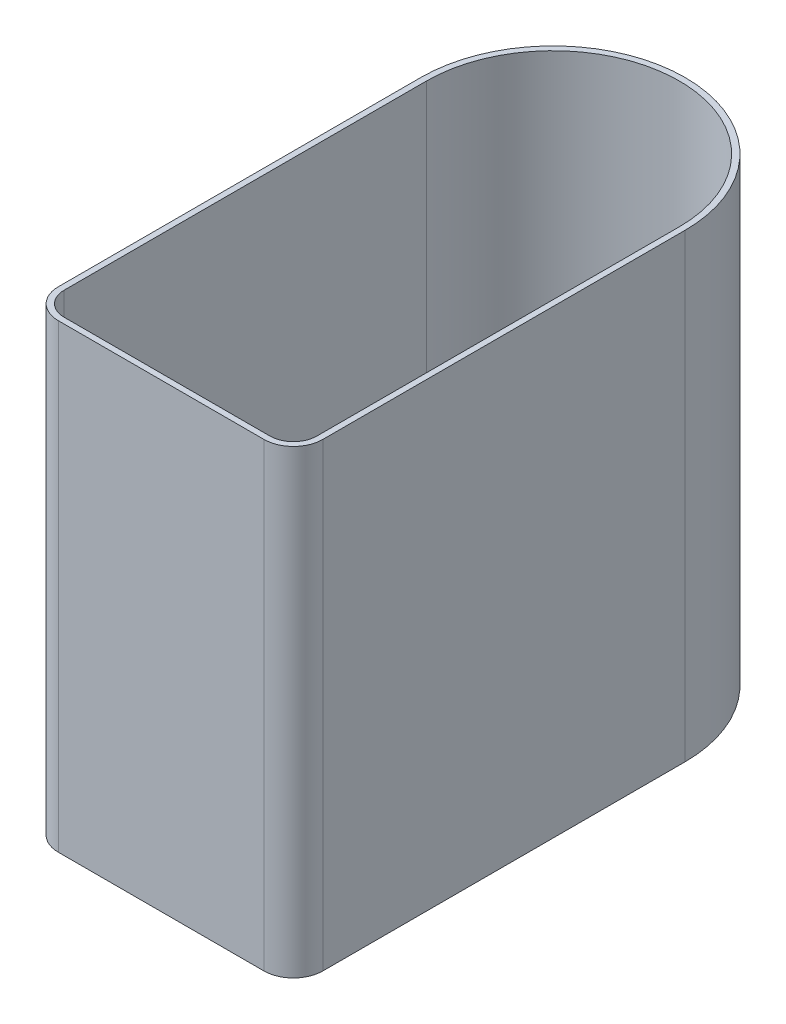
ISO-10303-21;
HEADER;
FILE_DESCRIPTION(('STEP AP214'),'2;1');
FILE_NAME('part.step','',(''),(''),'','','');
FILE_SCHEMA(('AUTOMOTIVE_DESIGN { 1 0 10303 214 1 1 1 1 }'));
ENDSEC;
DATA;
#1=APPLICATION_CONTEXT('core data for automotive mechanical design processes');
#2=APPLICATION_PROTOCOL_DEFINITION('international standard','automotive_design',2000,#1);
#3=PRODUCT_CONTEXT('',#1,'mechanical');
#4=PRODUCT('Part','Part','',(#3));
#5=PRODUCT_RELATED_PRODUCT_CATEGORY('part','',(#4));
#6=PRODUCT_DEFINITION_FORMATION('','',#4);
#7=PRODUCT_DEFINITION_CONTEXT('part definition',#1,'design');
#8=PRODUCT_DEFINITION('design','',#6,#7);
#9=PRODUCT_DEFINITION_SHAPE('','',#8);
#10=(LENGTH_UNIT() NAMED_UNIT(*) SI_UNIT(.MILLI.,.METRE.));
#11=(NAMED_UNIT(*) PLANE_ANGLE_UNIT() SI_UNIT($,.RADIAN.));
#12=(NAMED_UNIT(*) SI_UNIT($,.STERADIAN.) SOLID_ANGLE_UNIT());
#13=UNCERTAINTY_MEASURE_WITH_UNIT(LENGTH_MEASURE(1.E-05),#10,'distance_accuracy_value','');
#14=(GEOMETRIC_REPRESENTATION_CONTEXT(3) GLOBAL_UNCERTAINTY_ASSIGNED_CONTEXT((#13)) GLOBAL_UNIT_ASSIGNED_CONTEXT((#10,
#11,#12)) REPRESENTATION_CONTEXT('',''));
#15=CARTESIAN_POINT('',(0.,0.,0.));
#16=DIRECTION('',(0.,0.,1.));
#17=DIRECTION('',(1.,0.,0.));
#18=AXIS2_PLACEMENT_3D('',#15,#16,#17);
#19=CARTESIAN_POINT('',(-52.5,235.,85.));
#20=DIRECTION('',(0.,-1.,0.));
#21=DIRECTION('',(0.,0.,-1.));
#22=AXIS2_PLACEMENT_3D('',#19,#20,#21);
#23=CYLINDRICAL_SURFACE('',#22,15.);
#24=CARTESIAN_POINT('',(-52.5,0.,85.));
#25=DIRECTION('',(0.,-1.,0.));
#26=DIRECTION('',(0.,0.,-1.));
#27=AXIS2_PLACEMENT_3D('',#24,#25,#26);
#28=CIRCLE('',#27,15.);
#29=CARTESIAN_POINT('',(-52.4999999999999,0.,100.));
#30=VERTEX_POINT('',#29);
#31=CARTESIAN_POINT('',(-67.5,0.,84.9999999999999));
#32=VERTEX_POINT('',#31);
#33=EDGE_CURVE('E142',#30,#32,#28,.T.);
#34=ORIENTED_EDGE('',*,*,#33,.F.);
#35=DIRECTION('',(0.,-1.,0.));
#36=VECTOR('',#35,1.);
#37=CARTESIAN_POINT('',(-52.4999999999999,235.,100.));
#38=LINE('',#37,#36);
#39=CARTESIAN_POINT('',(-52.4999999999999,235.,100.));
#40=VERTEX_POINT('',#39);
#41=EDGE_CURVE('E11',#40,#30,#38,.T.);
#42=ORIENTED_EDGE('',*,*,#41,.F.);
#43=CARTESIAN_POINT('',(-52.5,235.,85.));
#44=DIRECTION('',(0.,-1.,0.));
#45=DIRECTION('',(0.,0.,-1.));
#46=AXIS2_PLACEMENT_3D('',#43,#44,#45);
#47=CIRCLE('',#46,15.);
#48=CARTESIAN_POINT('',(-67.5,235.,84.9999999999999));
#49=VERTEX_POINT('',#48);
#50=EDGE_CURVE('E163',#40,#49,#47,.T.);
#51=ORIENTED_EDGE('',*,*,#50,.T.);
#52=DIRECTION('',(0.,-1.,0.));
#53=VECTOR('',#52,1.);
#54=CARTESIAN_POINT('',(-67.5,235.,84.9999999999999));
#55=LINE('',#54,#53);
#56=EDGE_CURVE('E42',#49,#32,#55,.T.);
#57=ORIENTED_EDGE('',*,*,#56,.T.);
#58=EDGE_LOOP('',(#34,#42,#51,#57));
#59=FACE_BOUND('',#58,.T.);
#60=ADVANCED_FACE('F39',(#59),#23,.T.);
#61=CARTESIAN_POINT('',(52.4999999999999,235.,100.));
#62=DIRECTION('',(0.,0.,1.));
#63=DIRECTION('',(1.,0.,0.));
#64=AXIS2_PLACEMENT_3D('',#61,#62,#63);
#65=PLANE('',#64);
#66=DIRECTION('',(-1.,0.,0.));
#67=VECTOR('',#66,1.);
#68=CARTESIAN_POINT('',(52.4999999999999,0.,100.));
#69=LINE('',#68,#67);
#70=CARTESIAN_POINT('',(52.4999999999999,0.,100.));
#71=VERTEX_POINT('',#70);
#72=EDGE_CURVE('E160',#71,#30,#69,.T.);
#73=ORIENTED_EDGE('',*,*,#72,.F.);
#74=DIRECTION('',(0.,-1.,0.));
#75=VECTOR('',#74,1.);
#76=CARTESIAN_POINT('',(52.4999999999999,235.,100.));
#77=LINE('',#76,#75);
#78=CARTESIAN_POINT('',(52.4999999999999,235.,100.));
#79=VERTEX_POINT('',#78);
#80=EDGE_CURVE('E48',#79,#71,#77,.T.);
#81=ORIENTED_EDGE('',*,*,#80,.F.);
#82=DIRECTION('',(-1.,0.,0.));
#83=VECTOR('',#82,1.);
#84=CARTESIAN_POINT('',(52.4999999999999,235.,100.));
#85=LINE('',#84,#83);
#86=EDGE_CURVE('E115',#79,#40,#85,.T.);
#87=ORIENTED_EDGE('',*,*,#86,.T.);
#88=ORIENTED_EDGE('',*,*,#41,.T.);
#89=EDGE_LOOP('',(#73,#81,#87,#88));
#90=FACE_BOUND('',#89,.T.);
#91=ADVANCED_FACE('F176',(#90),#65,.T.);
#92=CARTESIAN_POINT('',(52.5,235.,85.));
#93=DIRECTION('',(0.,-1.,0.));
#94=DIRECTION('',(0.,0.,-1.));
#95=AXIS2_PLACEMENT_3D('',#92,#93,#94);
#96=CYLINDRICAL_SURFACE('',#95,15.);
#97=CARTESIAN_POINT('',(52.5,0.,85.));
#98=DIRECTION('',(0.,1.,0.));
#99=DIRECTION('',(0.,0.,1.));
#100=AXIS2_PLACEMENT_3D('',#97,#98,#99);
#101=CIRCLE('',#100,15.);
#102=CARTESIAN_POINT('',(67.5,0.,84.9999999999999));
#103=VERTEX_POINT('',#102);
#104=EDGE_CURVE('E123',#71,#103,#101,.T.);
#105=ORIENTED_EDGE('',*,*,#104,.T.);
#106=DIRECTION('',(0.,-1.,0.));
#107=VECTOR('',#106,1.);
#108=CARTESIAN_POINT('',(67.5,235.,84.9999999999999));
#109=LINE('',#108,#107);
#110=CARTESIAN_POINT('',(67.5,235.,84.9999999999999));
#111=VERTEX_POINT('',#110);
#112=EDGE_CURVE('E120',#111,#103,#109,.T.);
#113=ORIENTED_EDGE('',*,*,#112,.F.);
#114=CARTESIAN_POINT('',(52.5,235.,85.));
#115=DIRECTION('',(0.,1.,0.));
#116=DIRECTION('',(0.,0.,1.));
#117=AXIS2_PLACEMENT_3D('',#114,#115,#116);
#118=CIRCLE('',#117,15.);
#119=EDGE_CURVE('E109',#79,#111,#118,.T.);
#120=ORIENTED_EDGE('',*,*,#119,.F.);
#121=ORIENTED_EDGE('',*,*,#80,.T.);
#122=EDGE_LOOP('',(#105,#113,#120,#121));
#123=FACE_BOUND('',#122,.T.);
#124=ADVANCED_FACE('F121',(#123),#96,.T.);
#125=CARTESIAN_POINT('',(67.5,235.,84.9999999999999));
#126=DIRECTION('',(-1.,0.,0.));
#127=DIRECTION('',(0.,0.,1.));
#128=AXIS2_PLACEMENT_3D('',#125,#126,#127);
#129=PLANE('',#128);
#130=DIRECTION('',(0.,0.,-1.));
#131=VECTOR('',#130,1.);
#132=CARTESIAN_POINT('',(67.5,0.,84.9999999999999));
#133=LINE('',#132,#131);
#134=CARTESIAN_POINT('',(67.5,0.,-100.));
#135=VERTEX_POINT('',#134);
#136=EDGE_CURVE('E155',#103,#135,#133,.T.);
#137=ORIENTED_EDGE('',*,*,#136,.T.);
#138=DIRECTION('',(0.,-1.,0.));
#139=VECTOR('',#138,1.);
#140=CARTESIAN_POINT('',(67.5,235.,-100.));
#141=LINE('',#140,#139);
#142=CARTESIAN_POINT('',(67.5,235.,-100.));
#143=VERTEX_POINT('',#142);
#144=EDGE_CURVE('E127',#143,#135,#141,.T.);
#145=ORIENTED_EDGE('',*,*,#144,.F.);
#146=DIRECTION('',(0.,0.,-1.));
#147=VECTOR('',#146,1.);
#148=CARTESIAN_POINT('',(67.5,235.,84.9999999999999));
#149=LINE('',#148,#147);
#150=EDGE_CURVE('E113',#111,#143,#149,.T.);
#151=ORIENTED_EDGE('',*,*,#150,.F.);
#152=ORIENTED_EDGE('',*,*,#112,.T.);
#153=EDGE_LOOP('',(#137,#145,#151,#152));
#154=FACE_BOUND('',#153,.T.);
#155=ADVANCED_FACE('F129',(#154),#129,.F.);
#156=CARTESIAN_POINT('',(0.,235.,-100.));
#157=DIRECTION('',(0.,-1.,0.));
#158=DIRECTION('',(0.,0.,-1.));
#159=AXIS2_PLACEMENT_3D('',#156,#157,#158);
#160=CYLINDRICAL_SURFACE('',#159,67.5);
#161=CARTESIAN_POINT('',(0.,0.,-100.));
#162=DIRECTION('',(0.,1.,0.));
#163=DIRECTION('',(0.,0.,1.));
#164=AXIS2_PLACEMENT_3D('',#161,#162,#163);
#165=CIRCLE('',#164,67.5);
#166=CARTESIAN_POINT('',(-67.5,0.,-100.));
#167=VERTEX_POINT('',#166);
#168=EDGE_CURVE('E151',#135,#167,#165,.T.);
#169=ORIENTED_EDGE('',*,*,#168,.T.);
#170=DIRECTION('',(0.,-1.,0.));
#171=VECTOR('',#170,1.);
#172=CARTESIAN_POINT('',(-67.5,235.,-100.));
#173=LINE('',#172,#171);
#174=CARTESIAN_POINT('',(-67.5,235.,-100.));
#175=VERTEX_POINT('',#174);
#176=EDGE_CURVE('E168',#175,#167,#173,.T.);
#177=ORIENTED_EDGE('',*,*,#176,.F.);
#178=CARTESIAN_POINT('',(0.,235.,-100.));
#179=DIRECTION('',(0.,1.,0.));
#180=DIRECTION('',(0.,0.,1.));
#181=AXIS2_PLACEMENT_3D('',#178,#179,#180);
#182=CIRCLE('',#181,67.5);
#183=EDGE_CURVE('E133',#143,#175,#182,.T.);
#184=ORIENTED_EDGE('',*,*,#183,.F.);
#185=ORIENTED_EDGE('',*,*,#144,.T.);
#186=EDGE_LOOP('',(#169,#177,#184,#185));
#187=FACE_BOUND('',#186,.T.);
#188=ADVANCED_FACE('F189',(#187),#160,.T.);
#189=CARTESIAN_POINT('',(-67.5,235.,84.9999999999999));
#190=DIRECTION('',(-1.,0.,0.));
#191=DIRECTION('',(0.,0.,1.));
#192=AXIS2_PLACEMENT_3D('',#189,#190,#191);
#193=PLANE('',#192);
#194=DIRECTION('',(0.,0.,-1.));
#195=VECTOR('',#194,1.);
#196=CARTESIAN_POINT('',(-67.5,0.,84.9999999999999));
#197=LINE('',#196,#195);
#198=EDGE_CURVE('E146',#32,#167,#197,.T.);
#199=ORIENTED_EDGE('',*,*,#198,.F.);
#200=ORIENTED_EDGE('',*,*,#56,.F.);
#201=DIRECTION('',(0.,0.,-1.));
#202=VECTOR('',#201,1.);
#203=CARTESIAN_POINT('',(-67.5,235.,84.9999999999999));
#204=LINE('',#203,#202);
#205=EDGE_CURVE('E136',#49,#175,#204,.T.);
#206=ORIENTED_EDGE('',*,*,#205,.T.);
#207=ORIENTED_EDGE('',*,*,#176,.T.);
#208=EDGE_LOOP('',(#199,#200,#206,#207));
#209=FACE_BOUND('',#208,.T.);
#210=ADVANCED_FACE('F172',(#209),#193,.T.);
#211=CARTESIAN_POINT('',(-52.5,235.,85.));
#212=DIRECTION('',(0.,-1.,0.));
#213=DIRECTION('',(0.,0.,-1.));
#214=AXIS2_PLACEMENT_3D('',#211,#212,#213);
#215=PLANE('',#214);
#216=DIRECTION('',(-1.,0.,0.));
#217=VECTOR('',#216,1.);
#218=CARTESIAN_POINT('',(-52.5,235.,97.));
#219=LINE('',#218,#217);
#220=CARTESIAN_POINT('',(52.4999999999999,235.,97.));
#221=VERTEX_POINT('',#220);
#222=CARTESIAN_POINT('',(-52.4999999999999,235.,97.));
#223=VERTEX_POINT('',#222);
#224=EDGE_CURVE('E258',#221,#223,#219,.T.);
#225=ORIENTED_EDGE('',*,*,#224,.T.);
#226=CARTESIAN_POINT('',(-52.5,235.,85.));
#227=DIRECTION('',(0.,-1.,0.));
#228=DIRECTION('',(0.,0.,-1.));
#229=AXIS2_PLACEMENT_3D('',#226,#227,#228);
#230=CIRCLE('',#229,12.);
#231=CARTESIAN_POINT('',(-64.5,235.,84.9999999999999));
#232=VERTEX_POINT('',#231);
#233=EDGE_CURVE('E262',#223,#232,#230,.T.);
#234=ORIENTED_EDGE('',*,*,#233,.T.);
#235=DIRECTION('',(0.,0.,-1.));
#236=VECTOR('',#235,1.);
#237=CARTESIAN_POINT('',(-64.5,235.,85.));
#238=LINE('',#237,#236);
#239=CARTESIAN_POINT('',(-64.5,235.,-100.));
#240=VERTEX_POINT('',#239);
#241=EDGE_CURVE('E290',#232,#240,#238,.T.);
#242=ORIENTED_EDGE('',*,*,#241,.T.);
#243=CARTESIAN_POINT('',(0.,235.,-100.));
#244=DIRECTION('',(0.,-1.,0.));
#245=DIRECTION('',(0.,0.,-1.));
#246=AXIS2_PLACEMENT_3D('',#243,#244,#245);
#247=CIRCLE('',#246,64.5);
#248=CARTESIAN_POINT('',(64.5,235.,-100.));
#249=VERTEX_POINT('',#248);
#250=EDGE_CURVE('E301',#249,#240,#247,.F.);
#251=ORIENTED_EDGE('',*,*,#250,.F.);
#252=DIRECTION('',(0.,0.,-1.));
#253=VECTOR('',#252,1.);
#254=CARTESIAN_POINT('',(64.5,235.,85.));
#255=LINE('',#254,#253);
#256=CARTESIAN_POINT('',(64.5,235.,84.9999999999999));
#257=VERTEX_POINT('',#256);
#258=EDGE_CURVE('E297',#257,#249,#255,.T.);
#259=ORIENTED_EDGE('',*,*,#258,.F.);
#260=CARTESIAN_POINT('',(52.5,235.,85.));
#261=DIRECTION('',(0.,-1.,0.));
#262=DIRECTION('',(0.,0.,-1.));
#263=AXIS2_PLACEMENT_3D('',#260,#261,#262);
#264=CIRCLE('',#263,12.);
#265=EDGE_CURVE('E293',#221,#257,#264,.F.);
#266=ORIENTED_EDGE('',*,*,#265,.F.);
#267=EDGE_LOOP('',(#225,#234,#242,#251,#259,#266));
#268=FACE_BOUND('',#267,.T.);
#269=ORIENTED_EDGE('',*,*,#50,.F.);
#270=ORIENTED_EDGE('',*,*,#86,.F.);
#271=ORIENTED_EDGE('',*,*,#119,.T.);
#272=ORIENTED_EDGE('',*,*,#150,.T.);
#273=ORIENTED_EDGE('',*,*,#183,.T.);
#274=ORIENTED_EDGE('',*,*,#205,.F.);
#275=EDGE_LOOP('',(#269,#270,#271,#272,#273,#274));
#276=FACE_BOUND('',#275,.T.);
#277=ADVANCED_FACE('F111',(#268,#276),#215,.F.);
#278=CARTESIAN_POINT('',(-52.5,0.,85.));
#279=DIRECTION('',(0.,-1.,0.));
#280=DIRECTION('',(0.,0.,-1.));
#281=AXIS2_PLACEMENT_3D('',#278,#279,#280);
#282=PLANE('',#281);
#283=ORIENTED_EDGE('',*,*,#33,.T.);
#284=ORIENTED_EDGE('',*,*,#198,.T.);
#285=ORIENTED_EDGE('',*,*,#168,.F.);
#286=ORIENTED_EDGE('',*,*,#136,.F.);
#287=ORIENTED_EDGE('',*,*,#104,.F.);
#288=ORIENTED_EDGE('',*,*,#72,.T.);
#289=EDGE_LOOP('',(#283,#284,#285,#286,#287,#288));
#290=FACE_BOUND('',#289,.T.);
#291=ADVANCED_FACE('F175',(#290),#282,.T.);
#292=CARTESIAN_POINT('',(-52.5,235.,85.));
#293=DIRECTION('',(0.,-1.,0.));
#294=DIRECTION('',(0.,0.,-1.));
#295=AXIS2_PLACEMENT_3D('',#292,#293,#294);
#296=CYLINDRICAL_SURFACE('',#295,12.);
#297=CARTESIAN_POINT('',(-52.5,3.,85.));
#298=DIRECTION('',(0.,-1.,0.));
#299=DIRECTION('',(0.,0.,-1.));
#300=AXIS2_PLACEMENT_3D('',#297,#298,#299);
#301=CIRCLE('',#300,12.);
#302=CARTESIAN_POINT('',(-52.4999999999999,3.,97.));
#303=VERTEX_POINT('',#302);
#304=CARTESIAN_POINT('',(-64.5,3.,84.9999999999999));
#305=VERTEX_POINT('',#304);
#306=EDGE_CURVE('E235',#303,#305,#301,.T.);
#307=ORIENTED_EDGE('',*,*,#306,.T.);
#308=DIRECTION('',(0.,-1.,0.));
#309=VECTOR('',#308,1.);
#310=CARTESIAN_POINT('',(-64.5,235.,84.9999999999999));
#311=LINE('',#310,#309);
#312=EDGE_CURVE('E238',#232,#305,#311,.T.);
#313=ORIENTED_EDGE('',*,*,#312,.F.);
#314=ORIENTED_EDGE('',*,*,#233,.F.);
#315=DIRECTION('',(0.,1.,0.));
#316=VECTOR('',#315,1.);
#317=CARTESIAN_POINT('',(-52.4999999999999,235.,97.));
#318=LINE('',#317,#316);
#319=EDGE_CURVE('E147',#223,#303,#318,.F.);
#320=ORIENTED_EDGE('',*,*,#319,.T.);
#321=EDGE_LOOP('',(#307,#313,#314,#320));
#322=FACE_BOUND('',#321,.T.);
#323=ADVANCED_FACE('F200',(#322),#296,.F.);
#324=CARTESIAN_POINT('',(52.4999999999999,235.,97.));
#325=DIRECTION('',(0.,0.,1.));
#326=DIRECTION('',(1.,0.,0.));
#327=AXIS2_PLACEMENT_3D('',#324,#325,#326);
#328=PLANE('',#327);
#329=DIRECTION('',(-1.,0.,0.));
#330=VECTOR('',#329,1.);
#331=CARTESIAN_POINT('',(-52.5,3.,97.));
#332=LINE('',#331,#330);
#333=CARTESIAN_POINT('',(52.4999999999999,3.,97.));
#334=VERTEX_POINT('',#333);
#335=EDGE_CURVE('E259',#334,#303,#332,.T.);
#336=ORIENTED_EDGE('',*,*,#335,.T.);
#337=ORIENTED_EDGE('',*,*,#319,.F.);
#338=ORIENTED_EDGE('',*,*,#224,.F.);
#339=DIRECTION('',(0.,-1.,0.));
#340=VECTOR('',#339,1.);
#341=CARTESIAN_POINT('',(52.4999999999999,235.,97.));
#342=LINE('',#341,#340);
#343=EDGE_CURVE('E255',#221,#334,#342,.T.);
#344=ORIENTED_EDGE('',*,*,#343,.T.);
#345=EDGE_LOOP('',(#336,#337,#338,#344));
#346=FACE_BOUND('',#345,.T.);
#347=ADVANCED_FACE('F221',(#346),#328,.F.);
#348=CARTESIAN_POINT('',(52.5,235.,85.));
#349=DIRECTION('',(0.,-1.,0.));
#350=DIRECTION('',(0.,0.,-1.));
#351=AXIS2_PLACEMENT_3D('',#348,#349,#350);
#352=CYLINDRICAL_SURFACE('',#351,12.);
#353=CARTESIAN_POINT('',(52.5,3.,85.));
#354=DIRECTION('',(0.,-1.,0.));
#355=DIRECTION('',(0.,0.,-1.));
#356=AXIS2_PLACEMENT_3D('',#353,#354,#355);
#357=CIRCLE('',#356,12.);
#358=CARTESIAN_POINT('',(64.5,3.,84.9999999999999));
#359=VERTEX_POINT('',#358);
#360=EDGE_CURVE('E263',#334,#359,#357,.F.);
#361=ORIENTED_EDGE('',*,*,#360,.F.);
#362=ORIENTED_EDGE('',*,*,#343,.F.);
#363=ORIENTED_EDGE('',*,*,#265,.T.);
#364=DIRECTION('',(0.,1.,0.));
#365=VECTOR('',#364,1.);
#366=CARTESIAN_POINT('',(64.5,235.,84.9999999999999));
#367=LINE('',#366,#365);
#368=EDGE_CURVE('E267',#257,#359,#367,.F.);
#369=ORIENTED_EDGE('',*,*,#368,.T.);
#370=EDGE_LOOP('',(#361,#362,#363,#369));
#371=FACE_BOUND('',#370,.T.);
#372=ADVANCED_FACE('F217',(#371),#352,.F.);
#373=CARTESIAN_POINT('',(64.5,235.,84.9999999999999));
#374=DIRECTION('',(-1.,0.,0.));
#375=DIRECTION('',(0.,0.,1.));
#376=AXIS2_PLACEMENT_3D('',#373,#374,#375);
#377=PLANE('',#376);
#378=DIRECTION('',(0.,0.,-1.));
#379=VECTOR('',#378,1.);
#380=CARTESIAN_POINT('',(64.5,3.,85.));
#381=LINE('',#380,#379);
#382=CARTESIAN_POINT('',(64.5,3.,-100.));
#383=VERTEX_POINT('',#382);
#384=EDGE_CURVE('E271',#359,#383,#381,.T.);
#385=ORIENTED_EDGE('',*,*,#384,.F.);
#386=ORIENTED_EDGE('',*,*,#368,.F.);
#387=ORIENTED_EDGE('',*,*,#258,.T.);
#388=DIRECTION('',(0.,-1.,0.));
#389=VECTOR('',#388,1.);
#390=CARTESIAN_POINT('',(64.5,235.,-100.));
#391=LINE('',#390,#389);
#392=EDGE_CURVE('E275',#249,#383,#391,.T.);
#393=ORIENTED_EDGE('',*,*,#392,.T.);
#394=EDGE_LOOP('',(#385,#386,#387,#393));
#395=FACE_BOUND('',#394,.T.);
#396=ADVANCED_FACE('F213',(#395),#377,.T.);
#397=CARTESIAN_POINT('',(0.,235.,-100.));
#398=DIRECTION('',(0.,-1.,0.));
#399=DIRECTION('',(0.,0.,-1.));
#400=AXIS2_PLACEMENT_3D('',#397,#398,#399);
#401=CYLINDRICAL_SURFACE('',#400,64.5);
#402=CARTESIAN_POINT('',(0.,3.,-100.));
#403=DIRECTION('',(0.,-1.,0.));
#404=DIRECTION('',(0.,0.,-1.));
#405=AXIS2_PLACEMENT_3D('',#402,#403,#404);
#406=CIRCLE('',#405,64.5);
#407=CARTESIAN_POINT('',(-64.5,3.,-100.));
#408=VERTEX_POINT('',#407);
#409=EDGE_CURVE('E250',#383,#408,#406,.F.);
#410=ORIENTED_EDGE('',*,*,#409,.F.);
#411=ORIENTED_EDGE('',*,*,#392,.F.);
#412=ORIENTED_EDGE('',*,*,#250,.T.);
#413=DIRECTION('',(0.,1.,0.));
#414=VECTOR('',#413,1.);
#415=CARTESIAN_POINT('',(-64.5,235.,-100.));
#416=LINE('',#415,#414);
#417=EDGE_CURVE('E56',#240,#408,#416,.F.);
#418=ORIENTED_EDGE('',*,*,#417,.T.);
#419=EDGE_LOOP('',(#410,#411,#412,#418));
#420=FACE_BOUND('',#419,.T.);
#421=ADVANCED_FACE('F210',(#420),#401,.F.);
#422=CARTESIAN_POINT('',(-64.5,235.,84.9999999999999));
#423=DIRECTION('',(-1.,0.,0.));
#424=DIRECTION('',(0.,0.,1.));
#425=AXIS2_PLACEMENT_3D('',#422,#423,#424);
#426=PLANE('',#425);
#427=DIRECTION('',(0.,0.,-1.));
#428=VECTOR('',#427,1.);
#429=CARTESIAN_POINT('',(-64.5,3.,85.));
#430=LINE('',#429,#428);
#431=EDGE_CURVE('E247',#305,#408,#430,.T.);
#432=ORIENTED_EDGE('',*,*,#431,.T.);
#433=ORIENTED_EDGE('',*,*,#417,.F.);
#434=ORIENTED_EDGE('',*,*,#241,.F.);
#435=ORIENTED_EDGE('',*,*,#312,.T.);
#436=EDGE_LOOP('',(#432,#433,#434,#435));
#437=FACE_BOUND('',#436,.T.);
#438=ADVANCED_FACE('F206',(#437),#426,.F.);
#439=CARTESIAN_POINT('',(-52.5,3.,85.));
#440=DIRECTION('',(0.,-1.,0.));
#441=DIRECTION('',(0.,0.,-1.));
#442=AXIS2_PLACEMENT_3D('',#439,#440,#441);
#443=PLANE('',#442);
#444=ORIENTED_EDGE('',*,*,#306,.F.);
#445=ORIENTED_EDGE('',*,*,#335,.F.);
#446=ORIENTED_EDGE('',*,*,#360,.T.);
#447=ORIENTED_EDGE('',*,*,#384,.T.);
#448=ORIENTED_EDGE('',*,*,#409,.T.);
#449=ORIENTED_EDGE('',*,*,#431,.F.);
#450=EDGE_LOOP('',(#444,#445,#446,#447,#448,#449));
#451=FACE_BOUND('',#450,.T.);
#452=ADVANCED_FACE('F203',(#451),#443,.F.);
#453=CLOSED_SHELL('',(#60,#91,#124,#155,#188,#210,#277,#291,#323,#347,#372,#396,#421,#438,#452));
#454=MANIFOLD_SOLID_BREP('B2',#453);
#455=ADVANCED_BREP_SHAPE_REPRESENTATION('',(#18,#454),#14);
#456=SHAPE_DEFINITION_REPRESENTATION(#9,#455);
ENDSEC;
END-ISO-10303-21;
